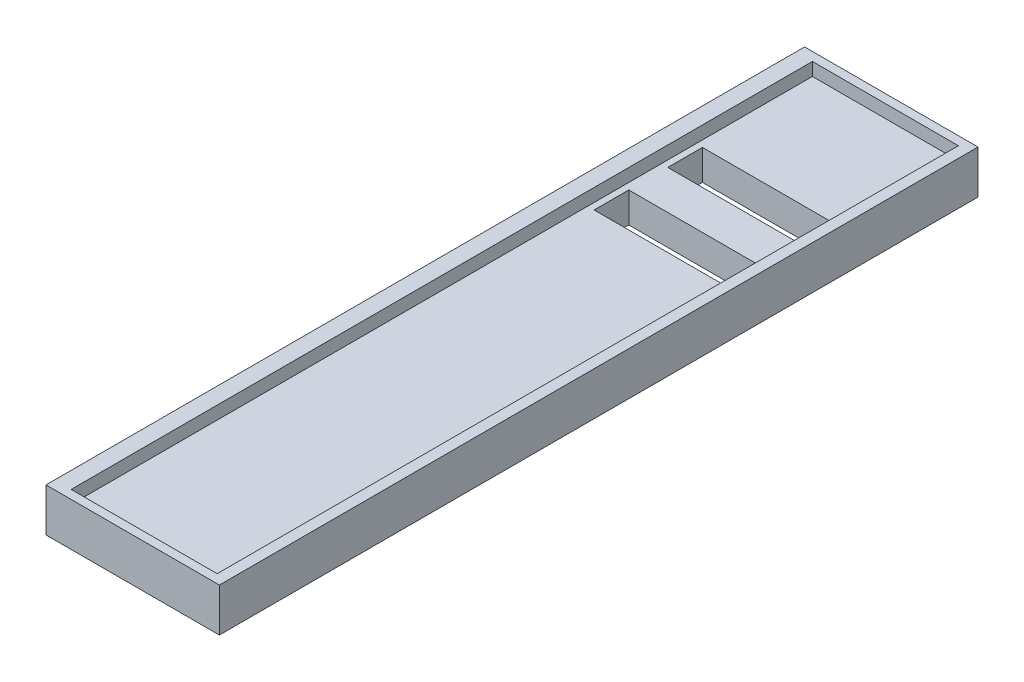
ISO-10303-21;
HEADER;
FILE_DESCRIPTION(('STEP AP214'),'2;1');
FILE_NAME('part.step','',(''),(''),'','','');
FILE_SCHEMA(('AUTOMOTIVE_DESIGN { 1 0 10303 214 1 1 1 1 }'));
ENDSEC;
DATA;
#1=APPLICATION_CONTEXT('core data for automotive mechanical design processes');
#2=APPLICATION_PROTOCOL_DEFINITION('international standard','automotive_design',2000,#1);
#3=PRODUCT_CONTEXT('',#1,'mechanical');
#4=PRODUCT('Part','Part','',(#3));
#5=PRODUCT_RELATED_PRODUCT_CATEGORY('part','',(#4));
#6=PRODUCT_DEFINITION_FORMATION('','',#4);
#7=PRODUCT_DEFINITION_CONTEXT('part definition',#1,'design');
#8=PRODUCT_DEFINITION('design','',#6,#7);
#9=PRODUCT_DEFINITION_SHAPE('','',#8);
#10=(LENGTH_UNIT() NAMED_UNIT(*) SI_UNIT(.MILLI.,.METRE.));
#11=(NAMED_UNIT(*) PLANE_ANGLE_UNIT() SI_UNIT($,.RADIAN.));
#12=(NAMED_UNIT(*) SI_UNIT($,.STERADIAN.) SOLID_ANGLE_UNIT());
#13=UNCERTAINTY_MEASURE_WITH_UNIT(LENGTH_MEASURE(1.E-05),#10,'distance_accuracy_value','');
#14=(GEOMETRIC_REPRESENTATION_CONTEXT(3) GLOBAL_UNCERTAINTY_ASSIGNED_CONTEXT((#13)) GLOBAL_UNIT_ASSIGNED_CONTEXT((#10,
#11,#12)) REPRESENTATION_CONTEXT('',''));
#15=CARTESIAN_POINT('',(0.,0.,0.));
#16=DIRECTION('',(0.,0.,1.));
#17=DIRECTION('',(1.,0.,0.));
#18=AXIS2_PLACEMENT_3D('',#15,#16,#17);
#19=CARTESIAN_POINT('',(-38.2318353475222,4.41481890999337,0.));
#20=DIRECTION('',(-1.,0.,0.));
#21=DIRECTION('',(0.,0.,1.));
#22=AXIS2_PLACEMENT_3D('',#19,#20,#21);
#23=PLANE('',#22);
#24=DIRECTION('',(0.,1.,0.));
#25=VECTOR('',#24,1.);
#26=CARTESIAN_POINT('',(-38.2318353475222,4.41481890999337,4.));
#27=LINE('',#26,#25);
#28=CARTESIAN_POINT('',(-38.2318353475222,-1.58518109000663,4.));
#29=VERTEX_POINT('',#28);
#30=CARTESIAN_POINT('',(-38.2318353475222,4.41481890999337,4.));
#31=VERTEX_POINT('',#30);
#32=EDGE_CURVE('E154',#29,#31,#27,.T.);
#33=ORIENTED_EDGE('',*,*,#32,.T.);
#34=DIRECTION('',(0.,0.,1.));
#35=VECTOR('',#34,1.);
#36=CARTESIAN_POINT('',(-38.2318353475222,4.41481890999337,0.));
#37=LINE('',#36,#35);
#38=CARTESIAN_POINT('',(-38.2318353475222,4.41481890999337,346.));
#39=VERTEX_POINT('',#38);
#40=EDGE_CURVE('E49',#31,#39,#37,.T.);
#41=ORIENTED_EDGE('',*,*,#40,.T.);
#42=DIRECTION('',(0.,-1.,0.));
#43=VECTOR('',#42,1.);
#44=CARTESIAN_POINT('',(-38.2318353475222,4.41481890999337,346.));
#45=LINE('',#44,#43);
#46=CARTESIAN_POINT('',(-38.2318353475222,-1.58518109000663,346.));
#47=VERTEX_POINT('',#46);
#48=EDGE_CURVE('E246',#39,#47,#45,.T.);
#49=ORIENTED_EDGE('',*,*,#48,.T.);
#50=DIRECTION('',(0.,0.,1.));
#51=VECTOR('',#50,1.);
#52=CARTESIAN_POINT('',(-38.2318353475222,-1.58518109000663,0.));
#53=LINE('',#52,#51);
#54=EDGE_CURVE('E168',#29,#47,#53,.T.);
#55=ORIENTED_EDGE('',*,*,#54,.F.);
#56=EDGE_LOOP('',(#33,#41,#49,#55));
#57=FACE_BOUND('',#56,.T.);
#58=ADVANCED_FACE('F34',(#57),#23,.F.);
#59=CARTESIAN_POINT('',(29.1238128532457,4.41481890999337,0.));
#60=DIRECTION('',(1.,0.,0.));
#61=DIRECTION('',(0.,0.,-1.));
#62=AXIS2_PLACEMENT_3D('',#59,#60,#61);
#63=PLANE('',#62);
#64=DIRECTION('',(0.,-1.,0.));
#65=VECTOR('',#64,1.);
#66=CARTESIAN_POINT('',(29.1238128532457,4.41481890999337,4.));
#67=LINE('',#66,#65);
#68=CARTESIAN_POINT('',(29.1238128532457,4.41481890999337,4.));
#69=VERTEX_POINT('',#68);
#70=CARTESIAN_POINT('',(29.1238128532457,-1.58518109000663,4.));
#71=VERTEX_POINT('',#70);
#72=EDGE_CURVE('E153',#69,#71,#67,.T.);
#73=ORIENTED_EDGE('',*,*,#72,.T.);
#74=DIRECTION('',(0.,0.,1.));
#75=VECTOR('',#74,1.);
#76=CARTESIAN_POINT('',(29.1238128532457,-1.58518109000663,0.));
#77=LINE('',#76,#75);
#78=CARTESIAN_POINT('',(29.1238128532457,-1.58518109000663,346.));
#79=VERTEX_POINT('',#78);
#80=EDGE_CURVE('E161',#71,#79,#77,.T.);
#81=ORIENTED_EDGE('',*,*,#80,.T.);
#82=DIRECTION('',(0.,1.,0.));
#83=VECTOR('',#82,1.);
#84=CARTESIAN_POINT('',(29.1238128532457,4.41481890999337,346.));
#85=LINE('',#84,#83);
#86=CARTESIAN_POINT('',(29.1238128532457,4.41481890999337,346.));
#87=VERTEX_POINT('',#86);
#88=EDGE_CURVE('E252',#79,#87,#85,.T.);
#89=ORIENTED_EDGE('',*,*,#88,.T.);
#90=DIRECTION('',(0.,0.,1.));
#91=VECTOR('',#90,1.);
#92=CARTESIAN_POINT('',(29.1238128532457,4.41481890999337,0.));
#93=LINE('',#92,#91);
#94=EDGE_CURVE('E57',#69,#87,#93,.T.);
#95=ORIENTED_EDGE('',*,*,#94,.F.);
#96=EDGE_LOOP('',(#73,#81,#89,#95));
#97=FACE_BOUND('',#96,.T.);
#98=ADVANCED_FACE('F160',(#97),#63,.F.);
#99=CARTESIAN_POINT('',(-38.2318353475222,-1.58518109000663,0.));
#100=DIRECTION('',(0.,-1.,0.));
#101=DIRECTION('',(0.,0.,-1.));
#102=AXIS2_PLACEMENT_3D('',#99,#100,#101);
#103=PLANE('',#102);
#104=DIRECTION('',(1.,0.,0.));
#105=VECTOR('',#104,1.);
#106=CARTESIAN_POINT('',(-35.250457763766,-1.58518109000663,107.711329479806));
#107=LINE('',#106,#105);
#108=CARTESIAN_POINT('',(-35.250457763766,-1.58518109000663,107.711329479806));
#109=VERTEX_POINT('',#108);
#110=CARTESIAN_POINT('',(25.0515059326233,-1.58518109000663,107.711329479806));
#111=VERTEX_POINT('',#110);
#112=EDGE_CURVE('E271',#109,#111,#107,.T.);
#113=ORIENTED_EDGE('',*,*,#112,.F.);
#114=DIRECTION('',(0.,0.,1.));
#115=VECTOR('',#114,1.);
#116=CARTESIAN_POINT('',(-35.250457763766,-1.58518109000663,91.7113294798061));
#117=LINE('',#116,#115);
#118=CARTESIAN_POINT('',(-35.250457763766,-1.58518109000663,91.7113294798061));
#119=VERTEX_POINT('',#118);
#120=EDGE_CURVE('E256',#119,#109,#117,.T.);
#121=ORIENTED_EDGE('',*,*,#120,.F.);
#122=DIRECTION('',(-1.,0.,0.));
#123=VECTOR('',#122,1.);
#124=CARTESIAN_POINT('',(-35.250457763766,-1.58518109000663,91.7113294798061));
#125=LINE('',#124,#123);
#126=CARTESIAN_POINT('',(25.0515059326233,-1.58518109000663,91.7113294798061));
#127=VERTEX_POINT('',#126);
#128=EDGE_CURVE('E261',#127,#119,#125,.T.);
#129=ORIENTED_EDGE('',*,*,#128,.F.);
#130=DIRECTION('',(0.,0.,-1.));
#131=VECTOR('',#130,1.);
#132=CARTESIAN_POINT('',(25.0515059326233,-1.58518109000663,91.7113294798061));
#133=LINE('',#132,#131);
#134=EDGE_CURVE('E274',#111,#127,#133,.T.);
#135=ORIENTED_EDGE('',*,*,#134,.F.);
#136=EDGE_LOOP('',(#113,#121,#129,#135));
#137=FACE_BOUND('',#136,.T.);
#138=DIRECTION('',(1.,0.,0.));
#139=VECTOR('',#138,1.);
#140=CARTESIAN_POINT('',(-35.250457763766,-1.58518109000663,73.7113294798061));
#141=LINE('',#140,#139);
#142=CARTESIAN_POINT('',(-35.250457763766,-1.58518109000663,73.7113294798061));
#143=VERTEX_POINT('',#142);
#144=CARTESIAN_POINT('',(25.0515059326233,-1.58518109000663,73.7113294798061));
#145=VERTEX_POINT('',#144);
#146=EDGE_CURVE('E303',#143,#145,#141,.T.);
#147=ORIENTED_EDGE('',*,*,#146,.F.);
#148=DIRECTION('',(0.,0.,1.));
#149=VECTOR('',#148,1.);
#150=CARTESIAN_POINT('',(-35.250457763766,-1.58518109000663,73.7113294798061));
#151=LINE('',#150,#149);
#152=CARTESIAN_POINT('',(-35.250457763766,-1.58518109000663,57.7113294798061));
#153=VERTEX_POINT('',#152);
#154=EDGE_CURVE('E281',#153,#143,#151,.T.);
#155=ORIENTED_EDGE('',*,*,#154,.F.);
#156=DIRECTION('',(-1.,0.,0.));
#157=VECTOR('',#156,1.);
#158=CARTESIAN_POINT('',(-35.250457763766,-1.58518109000663,57.7113294798061));
#159=LINE('',#158,#157);
#160=CARTESIAN_POINT('',(25.0515059326233,-1.58518109000663,57.7113294798061));
#161=VERTEX_POINT('',#160);
#162=EDGE_CURVE('E292',#161,#153,#159,.T.);
#163=ORIENTED_EDGE('',*,*,#162,.F.);
#164=DIRECTION('',(0.,0.,-1.));
#165=VECTOR('',#164,1.);
#166=CARTESIAN_POINT('',(25.0515059326233,-1.58518109000663,73.7113294798061));
#167=LINE('',#166,#165);
#168=EDGE_CURVE('E306',#145,#161,#167,.T.);
#169=ORIENTED_EDGE('',*,*,#168,.F.);
#170=EDGE_LOOP('',(#147,#155,#163,#169));
#171=FACE_BOUND('',#170,.T.);
#172=DIRECTION('',(-1.,0.,0.));
#173=VECTOR('',#172,1.);
#174=CARTESIAN_POINT('',(29.1238128532457,-1.58518109000663,4.));
#175=LINE('',#174,#173);
#176=EDGE_CURVE('E150',#71,#29,#175,.T.);
#177=ORIENTED_EDGE('',*,*,#176,.T.);
#178=ORIENTED_EDGE('',*,*,#54,.T.);
#179=DIRECTION('',(1.,0.,0.));
#180=VECTOR('',#179,1.);
#181=CARTESIAN_POINT('',(-38.2318353475222,-1.58518109000663,346.));
#182=LINE('',#181,#180);
#183=EDGE_CURVE('E166',#47,#79,#182,.T.);
#184=ORIENTED_EDGE('',*,*,#183,.T.);
#185=ORIENTED_EDGE('',*,*,#80,.F.);
#186=EDGE_LOOP('',(#177,#178,#184,#185));
#187=FACE_BOUND('',#186,.T.);
#188=ADVANCED_FACE('F164',(#137,#171,#187),#103,.F.);
#189=CARTESIAN_POINT('',(-45.8316221765914,4.41481890999337,350.));
#190=DIRECTION('',(1.,0.,0.));
#191=DIRECTION('',(0.,0.,-1.));
#192=AXIS2_PLACEMENT_3D('',#189,#190,#191);
#193=PLANE('',#192);
#194=DIRECTION('',(0.,-1.,0.));
#195=VECTOR('',#194,1.);
#196=CARTESIAN_POINT('',(-45.8316221765914,4.41481890999337,0.));
#197=LINE('',#196,#195);
#198=CARTESIAN_POINT('',(-45.8316221765914,4.41481890999337,0.));
#199=VERTEX_POINT('',#198);
#200=CARTESIAN_POINT('',(-45.8316221765914,-15.5851810900066,0.));
#201=VERTEX_POINT('',#200);
#202=EDGE_CURVE('E186',#199,#201,#197,.T.);
#203=ORIENTED_EDGE('',*,*,#202,.T.);
#204=DIRECTION('',(0.,0.,-1.));
#205=VECTOR('',#204,1.);
#206=CARTESIAN_POINT('',(-45.8316221765914,-15.5851810900066,350.));
#207=LINE('',#206,#205);
#208=CARTESIAN_POINT('',(-45.8316221765914,-15.5851810900066,350.));
#209=VERTEX_POINT('',#208);
#210=EDGE_CURVE('E11',#209,#201,#207,.T.);
#211=ORIENTED_EDGE('',*,*,#210,.F.);
#212=DIRECTION('',(0.,-1.,0.));
#213=VECTOR('',#212,1.);
#214=CARTESIAN_POINT('',(-45.8316221765914,4.41481890999337,350.));
#215=LINE('',#214,#213);
#216=CARTESIAN_POINT('',(-45.8316221765914,4.41481890999337,350.));
#217=VERTEX_POINT('',#216);
#218=EDGE_CURVE('E175',#217,#209,#215,.T.);
#219=ORIENTED_EDGE('',*,*,#218,.F.);
#220=DIRECTION('',(0.,0.,-1.));
#221=VECTOR('',#220,1.);
#222=CARTESIAN_POINT('',(-45.8316221765914,4.41481890999337,350.));
#223=LINE('',#222,#221);
#224=EDGE_CURVE('E185',#217,#199,#223,.T.);
#225=ORIENTED_EDGE('',*,*,#224,.T.);
#226=EDGE_LOOP('',(#203,#211,#219,#225));
#227=FACE_BOUND('',#226,.T.);
#228=ADVANCED_FACE('F36',(#227),#193,.F.);
#229=CARTESIAN_POINT('',(-45.8316221765914,-15.5851810900066,350.));
#230=DIRECTION('',(0.,1.,0.));
#231=DIRECTION('',(0.,0.,1.));
#232=AXIS2_PLACEMENT_3D('',#229,#230,#231);
#233=PLANE('',#232);
#234=DIRECTION('',(-1.,0.,0.));
#235=VECTOR('',#234,1.);
#236=CARTESIAN_POINT('',(-35.250457763766,-15.5851810900066,91.7113294798061));
#237=LINE('',#236,#235);
#238=CARTESIAN_POINT('',(25.0515059326233,-15.5851810900066,91.7113294798061));
#239=VERTEX_POINT('',#238);
#240=CARTESIAN_POINT('',(-35.250457763766,-15.5851810900066,91.7113294798061));
#241=VERTEX_POINT('',#240);
#242=EDGE_CURVE('E267',#239,#241,#237,.T.);
#243=ORIENTED_EDGE('',*,*,#242,.T.);
#244=DIRECTION('',(0.,0.,1.));
#245=VECTOR('',#244,1.);
#246=CARTESIAN_POINT('',(-35.250457763766,-15.5851810900066,91.7113294798061));
#247=LINE('',#246,#245);
#248=CARTESIAN_POINT('',(-35.250457763766,-15.5851810900066,107.711329479806));
#249=VERTEX_POINT('',#248);
#250=EDGE_CURVE('E257',#241,#249,#247,.T.);
#251=ORIENTED_EDGE('',*,*,#250,.T.);
#252=DIRECTION('',(1.,0.,0.));
#253=VECTOR('',#252,1.);
#254=CARTESIAN_POINT('',(-35.250457763766,-15.5851810900066,107.711329479806));
#255=LINE('',#254,#253);
#256=CARTESIAN_POINT('',(25.0515059326233,-15.5851810900066,107.711329479806));
#257=VERTEX_POINT('',#256);
#258=EDGE_CURVE('E260',#249,#257,#255,.T.);
#259=ORIENTED_EDGE('',*,*,#258,.T.);
#260=DIRECTION('',(0.,0.,-1.));
#261=VECTOR('',#260,1.);
#262=CARTESIAN_POINT('',(25.0515059326233,-15.5851810900066,91.7113294798061));
#263=LINE('',#262,#261);
#264=EDGE_CURVE('E264',#257,#239,#263,.T.);
#265=ORIENTED_EDGE('',*,*,#264,.T.);
#266=EDGE_LOOP('',(#243,#251,#259,#265));
#267=FACE_BOUND('',#266,.T.);
#268=DIRECTION('',(-1.,0.,0.));
#269=VECTOR('',#268,1.);
#270=CARTESIAN_POINT('',(-35.250457763766,-15.5851810900066,57.7113294798061));
#271=LINE('',#270,#269);
#272=CARTESIAN_POINT('',(25.0515059326233,-15.5851810900066,57.7113294798061));
#273=VERTEX_POINT('',#272);
#274=CARTESIAN_POINT('',(-35.250457763766,-15.5851810900066,57.7113294798061));
#275=VERTEX_POINT('',#274);
#276=EDGE_CURVE('E298',#273,#275,#271,.T.);
#277=ORIENTED_EDGE('',*,*,#276,.T.);
#278=DIRECTION('',(0.,0.,1.));
#279=VECTOR('',#278,1.);
#280=CARTESIAN_POINT('',(-35.250457763766,-15.5851810900066,73.7113294798061));
#281=LINE('',#280,#279);
#282=CARTESIAN_POINT('',(-35.250457763766,-15.5851810900066,73.7113294798061));
#283=VERTEX_POINT('',#282);
#284=EDGE_CURVE('E288',#275,#283,#281,.T.);
#285=ORIENTED_EDGE('',*,*,#284,.T.);
#286=DIRECTION('',(1.,0.,0.));
#287=VECTOR('',#286,1.);
#288=CARTESIAN_POINT('',(-35.250457763766,-15.5851810900066,73.7113294798061));
#289=LINE('',#288,#287);
#290=CARTESIAN_POINT('',(25.0515059326233,-15.5851810900066,73.7113294798061));
#291=VERTEX_POINT('',#290);
#292=EDGE_CURVE('E291',#283,#291,#289,.T.);
#293=ORIENTED_EDGE('',*,*,#292,.T.);
#294=DIRECTION('',(0.,0.,-1.));
#295=VECTOR('',#294,1.);
#296=CARTESIAN_POINT('',(25.0515059326233,-15.5851810900066,73.7113294798061));
#297=LINE('',#296,#295);
#298=EDGE_CURVE('E295',#291,#273,#297,.T.);
#299=ORIENTED_EDGE('',*,*,#298,.T.);
#300=EDGE_LOOP('',(#277,#285,#293,#299));
#301=FACE_BOUND('',#300,.T.);
#302=DIRECTION('',(1.,0.,0.));
#303=VECTOR('',#302,1.);
#304=CARTESIAN_POINT('',(-45.8316221765914,-15.5851810900066,0.));
#305=LINE('',#304,#303);
#306=CARTESIAN_POINT('',(34.1683778234086,-15.5851810900066,0.));
#307=VERTEX_POINT('',#306);
#308=EDGE_CURVE('E189',#201,#307,#305,.T.);
#309=ORIENTED_EDGE('',*,*,#308,.T.);
#310=DIRECTION('',(0.,0.,-1.));
#311=VECTOR('',#310,1.);
#312=CARTESIAN_POINT('',(34.1683778234086,-15.5851810900066,350.));
#313=LINE('',#312,#311);
#314=CARTESIAN_POINT('',(34.1683778234086,-15.5851810900066,350.));
#315=VERTEX_POINT('',#314);
#316=EDGE_CURVE('E42',#315,#307,#313,.T.);
#317=ORIENTED_EDGE('',*,*,#316,.F.);
#318=DIRECTION('',(1.,0.,0.));
#319=VECTOR('',#318,1.);
#320=CARTESIAN_POINT('',(-45.8316221765914,-15.5851810900066,350.));
#321=LINE('',#320,#319);
#322=EDGE_CURVE('E178',#209,#315,#321,.T.);
#323=ORIENTED_EDGE('',*,*,#322,.F.);
#324=ORIENTED_EDGE('',*,*,#210,.T.);
#325=EDGE_LOOP('',(#309,#317,#323,#324));
#326=FACE_BOUND('',#325,.T.);
#327=ADVANCED_FACE('F219',(#267,#301,#326),#233,.F.);
#328=CARTESIAN_POINT('',(34.1683778234086,4.41481890999337,350.));
#329=DIRECTION('',(-1.,0.,0.));
#330=DIRECTION('',(0.,0.,1.));
#331=AXIS2_PLACEMENT_3D('',#328,#329,#330);
#332=PLANE('',#331);
#333=DIRECTION('',(0.,1.,0.));
#334=VECTOR('',#333,1.);
#335=CARTESIAN_POINT('',(34.1683778234086,4.41481890999337,0.));
#336=LINE('',#335,#334);
#337=CARTESIAN_POINT('',(34.1683778234086,4.41481890999337,0.));
#338=VERTEX_POINT('',#337);
#339=EDGE_CURVE('E191',#307,#338,#336,.T.);
#340=ORIENTED_EDGE('',*,*,#339,.T.);
#341=DIRECTION('',(0.,0.,-1.));
#342=VECTOR('',#341,1.);
#343=CARTESIAN_POINT('',(34.1683778234086,4.41481890999337,350.));
#344=LINE('',#343,#342);
#345=CARTESIAN_POINT('',(34.1683778234086,4.41481890999337,350.));
#346=VERTEX_POINT('',#345);
#347=EDGE_CURVE('E196',#346,#338,#344,.T.);
#348=ORIENTED_EDGE('',*,*,#347,.F.);
#349=DIRECTION('',(0.,1.,0.));
#350=VECTOR('',#349,1.);
#351=CARTESIAN_POINT('',(34.1683778234086,4.41481890999337,350.));
#352=LINE('',#351,#350);
#353=EDGE_CURVE('E181',#315,#346,#352,.T.);
#354=ORIENTED_EDGE('',*,*,#353,.F.);
#355=ORIENTED_EDGE('',*,*,#316,.T.);
#356=EDGE_LOOP('',(#340,#348,#354,#355));
#357=FACE_BOUND('',#356,.T.);
#358=ADVANCED_FACE('F203',(#357),#332,.F.);
#359=CARTESIAN_POINT('',(-45.8316221765914,4.41481890999337,350.));
#360=DIRECTION('',(0.,-1.,0.));
#361=DIRECTION('',(0.,0.,-1.));
#362=AXIS2_PLACEMENT_3D('',#359,#360,#361);
#363=PLANE('',#362);
#364=DIRECTION('',(1.,0.,0.));
#365=VECTOR('',#364,1.);
#366=CARTESIAN_POINT('',(29.1238128532457,4.41481890999337,4.));
#367=LINE('',#366,#365);
#368=EDGE_CURVE('E245',#31,#69,#367,.T.);
#369=ORIENTED_EDGE('',*,*,#368,.T.);
#370=ORIENTED_EDGE('',*,*,#94,.T.);
#371=DIRECTION('',(-1.,0.,0.));
#372=VECTOR('',#371,1.);
#373=CARTESIAN_POINT('',(-38.2318353475222,4.41481890999337,346.));
#374=LINE('',#373,#372);
#375=EDGE_CURVE('E254',#87,#39,#374,.T.);
#376=ORIENTED_EDGE('',*,*,#375,.T.);
#377=ORIENTED_EDGE('',*,*,#40,.F.);
#378=EDGE_LOOP('',(#369,#370,#376,#377));
#379=FACE_BOUND('',#378,.T.);
#380=DIRECTION('',(-1.,0.,0.));
#381=VECTOR('',#380,1.);
#382=CARTESIAN_POINT('',(-45.8316221765914,4.41481890999337,0.));
#383=LINE('',#382,#381);
#384=EDGE_CURVE('E179',#338,#199,#383,.T.);
#385=ORIENTED_EDGE('',*,*,#384,.T.);
#386=ORIENTED_EDGE('',*,*,#224,.F.);
#387=DIRECTION('',(-1.,0.,0.));
#388=VECTOR('',#387,1.);
#389=CARTESIAN_POINT('',(-45.8316221765914,4.41481890999337,350.));
#390=LINE('',#389,#388);
#391=EDGE_CURVE('E183',#346,#217,#390,.T.);
#392=ORIENTED_EDGE('',*,*,#391,.F.);
#393=ORIENTED_EDGE('',*,*,#347,.T.);
#394=EDGE_LOOP('',(#385,#386,#392,#393));
#395=FACE_BOUND('',#394,.T.);
#396=ADVANCED_FACE('F212',(#379,#395),#363,.F.);
#397=CARTESIAN_POINT('',(0.,0.,350.));
#398=DIRECTION('',(0.,0.,1.));
#399=DIRECTION('',(1.,0.,0.));
#400=AXIS2_PLACEMENT_3D('',#397,#398,#399);
#401=PLANE('',#400);
#402=ORIENTED_EDGE('',*,*,#391,.T.);
#403=ORIENTED_EDGE('',*,*,#218,.T.);
#404=ORIENTED_EDGE('',*,*,#322,.T.);
#405=ORIENTED_EDGE('',*,*,#353,.T.);
#406=EDGE_LOOP('',(#402,#403,#404,#405));
#407=FACE_BOUND('',#406,.T.);
#408=ADVANCED_FACE('F218',(#407),#401,.T.);
#409=CARTESIAN_POINT('',(0.,0.,0.));
#410=DIRECTION('',(0.,0.,1.));
#411=DIRECTION('',(1.,0.,0.));
#412=AXIS2_PLACEMENT_3D('',#409,#410,#411);
#413=PLANE('',#412);
#414=ORIENTED_EDGE('',*,*,#202,.F.);
#415=ORIENTED_EDGE('',*,*,#384,.F.);
#416=ORIENTED_EDGE('',*,*,#339,.F.);
#417=ORIENTED_EDGE('',*,*,#308,.F.);
#418=EDGE_LOOP('',(#414,#415,#416,#417));
#419=FACE_BOUND('',#418,.T.);
#420=ADVANCED_FACE('F209',(#419),#413,.F.);
#421=CARTESIAN_POINT('',(-35.250457763766,-15.5851810900066,73.7113294798061));
#422=DIRECTION('',(-1.,0.,0.));
#423=DIRECTION('',(0.,0.,1.));
#424=AXIS2_PLACEMENT_3D('',#421,#422,#423);
#425=PLANE('',#424);
#426=ORIENTED_EDGE('',*,*,#154,.T.);
#427=DIRECTION('',(0.,1.,0.));
#428=VECTOR('',#427,1.);
#429=CARTESIAN_POINT('',(-35.250457763766,-15.5851810900066,73.7113294798061));
#430=LINE('',#429,#428);
#431=EDGE_CURVE('E301',#283,#143,#430,.T.);
#432=ORIENTED_EDGE('',*,*,#431,.F.);
#433=ORIENTED_EDGE('',*,*,#284,.F.);
#434=DIRECTION('',(0.,1.,0.));
#435=VECTOR('',#434,1.);
#436=CARTESIAN_POINT('',(-35.250457763766,-15.5851810900066,57.7113294798061));
#437=LINE('',#436,#435);
#438=EDGE_CURVE('E171',#275,#153,#437,.T.);
#439=ORIENTED_EDGE('',*,*,#438,.T.);
#440=EDGE_LOOP('',(#426,#432,#433,#439));
#441=FACE_BOUND('',#440,.T.);
#442=ADVANCED_FACE('F241',(#441),#425,.F.);
#443=CARTESIAN_POINT('',(-35.250457763766,-15.5851810900066,57.7113294798061));
#444=DIRECTION('',(0.,0.,-1.));
#445=DIRECTION('',(-1.,0.,0.));
#446=AXIS2_PLACEMENT_3D('',#443,#444,#445);
#447=PLANE('',#446);
#448=ORIENTED_EDGE('',*,*,#162,.T.);
#449=ORIENTED_EDGE('',*,*,#438,.F.);
#450=ORIENTED_EDGE('',*,*,#276,.F.);
#451=DIRECTION('',(0.,1.,0.));
#452=VECTOR('',#451,1.);
#453=CARTESIAN_POINT('',(25.0515059326233,-15.5851810900066,57.7113294798061));
#454=LINE('',#453,#452);
#455=EDGE_CURVE('E312',#273,#161,#454,.T.);
#456=ORIENTED_EDGE('',*,*,#455,.T.);
#457=EDGE_LOOP('',(#448,#449,#450,#456));
#458=FACE_BOUND('',#457,.T.);
#459=ADVANCED_FACE('F332',(#458),#447,.F.);
#460=CARTESIAN_POINT('',(25.0515059326233,-15.5851810900066,73.7113294798061));
#461=DIRECTION('',(1.,0.,0.));
#462=DIRECTION('',(0.,0.,-1.));
#463=AXIS2_PLACEMENT_3D('',#460,#461,#462);
#464=PLANE('',#463);
#465=ORIENTED_EDGE('',*,*,#168,.T.);
#466=ORIENTED_EDGE('',*,*,#455,.F.);
#467=ORIENTED_EDGE('',*,*,#298,.F.);
#468=DIRECTION('',(0.,1.,0.));
#469=VECTOR('',#468,1.);
#470=CARTESIAN_POINT('',(25.0515059326233,-15.5851810900066,73.7113294798061));
#471=LINE('',#470,#469);
#472=EDGE_CURVE('E314',#291,#145,#471,.T.);
#473=ORIENTED_EDGE('',*,*,#472,.T.);
#474=EDGE_LOOP('',(#465,#466,#467,#473));
#475=FACE_BOUND('',#474,.T.);
#476=ADVANCED_FACE('F329',(#475),#464,.F.);
#477=CARTESIAN_POINT('',(-35.250457763766,-15.5851810900066,73.7113294798061));
#478=DIRECTION('',(0.,0.,1.));
#479=DIRECTION('',(1.,0.,0.));
#480=AXIS2_PLACEMENT_3D('',#477,#478,#479);
#481=PLANE('',#480);
#482=ORIENTED_EDGE('',*,*,#146,.T.);
#483=ORIENTED_EDGE('',*,*,#472,.F.);
#484=ORIENTED_EDGE('',*,*,#292,.F.);
#485=ORIENTED_EDGE('',*,*,#431,.T.);
#486=EDGE_LOOP('',(#482,#483,#484,#485));
#487=FACE_BOUND('',#486,.T.);
#488=ADVANCED_FACE('F320',(#487),#481,.F.);
#489=CARTESIAN_POINT('',(-35.250457763766,-15.5851810900066,91.7113294798061));
#490=DIRECTION('',(-1.,0.,0.));
#491=DIRECTION('',(0.,0.,1.));
#492=AXIS2_PLACEMENT_3D('',#489,#490,#491);
#493=PLANE('',#492);
#494=ORIENTED_EDGE('',*,*,#120,.T.);
#495=DIRECTION('',(0.,1.,0.));
#496=VECTOR('',#495,1.);
#497=CARTESIAN_POINT('',(-35.250457763766,-15.5851810900066,107.711329479806));
#498=LINE('',#497,#496);
#499=EDGE_CURVE('E269',#249,#109,#498,.T.);
#500=ORIENTED_EDGE('',*,*,#499,.F.);
#501=ORIENTED_EDGE('',*,*,#250,.F.);
#502=DIRECTION('',(0.,1.,0.));
#503=VECTOR('',#502,1.);
#504=CARTESIAN_POINT('',(-35.250457763766,-15.5851810900066,91.7113294798061));
#505=LINE('',#504,#503);
#506=EDGE_CURVE('E279',#241,#119,#505,.T.);
#507=ORIENTED_EDGE('',*,*,#506,.T.);
#508=EDGE_LOOP('',(#494,#500,#501,#507));
#509=FACE_BOUND('',#508,.T.);
#510=ADVANCED_FACE('F342',(#509),#493,.F.);
#511=CARTESIAN_POINT('',(-35.250457763766,-15.5851810900066,91.7113294798061));
#512=DIRECTION('',(0.,0.,-1.));
#513=DIRECTION('',(-1.,0.,0.));
#514=AXIS2_PLACEMENT_3D('',#511,#512,#513);
#515=PLANE('',#514);
#516=ORIENTED_EDGE('',*,*,#128,.T.);
#517=ORIENTED_EDGE('',*,*,#506,.F.);
#518=ORIENTED_EDGE('',*,*,#242,.F.);
#519=DIRECTION('',(0.,1.,0.));
#520=VECTOR('',#519,1.);
#521=CARTESIAN_POINT('',(25.0515059326233,-15.5851810900066,91.7113294798061));
#522=LINE('',#521,#520);
#523=EDGE_CURVE('E282',#239,#127,#522,.T.);
#524=ORIENTED_EDGE('',*,*,#523,.T.);
#525=EDGE_LOOP('',(#516,#517,#518,#524));
#526=FACE_BOUND('',#525,.T.);
#527=ADVANCED_FACE('F349',(#526),#515,.F.);
#528=CARTESIAN_POINT('',(25.0515059326233,-15.5851810900066,91.7113294798061));
#529=DIRECTION('',(1.,0.,0.));
#530=DIRECTION('',(0.,0.,-1.));
#531=AXIS2_PLACEMENT_3D('',#528,#529,#530);
#532=PLANE('',#531);
#533=ORIENTED_EDGE('',*,*,#134,.T.);
#534=ORIENTED_EDGE('',*,*,#523,.F.);
#535=ORIENTED_EDGE('',*,*,#264,.F.);
#536=DIRECTION('',(0.,1.,0.));
#537=VECTOR('',#536,1.);
#538=CARTESIAN_POINT('',(25.0515059326233,-15.5851810900066,107.711329479806));
#539=LINE('',#538,#537);
#540=EDGE_CURVE('E284',#257,#111,#539,.T.);
#541=ORIENTED_EDGE('',*,*,#540,.T.);
#542=EDGE_LOOP('',(#533,#534,#535,#541));
#543=FACE_BOUND('',#542,.T.);
#544=ADVANCED_FACE('F354',(#543),#532,.F.);
#545=CARTESIAN_POINT('',(-35.250457763766,-15.5851810900066,107.711329479806));
#546=DIRECTION('',(0.,0.,1.));
#547=DIRECTION('',(1.,0.,0.));
#548=AXIS2_PLACEMENT_3D('',#545,#546,#547);
#549=PLANE('',#548);
#550=ORIENTED_EDGE('',*,*,#112,.T.);
#551=ORIENTED_EDGE('',*,*,#540,.F.);
#552=ORIENTED_EDGE('',*,*,#258,.F.);
#553=ORIENTED_EDGE('',*,*,#499,.T.);
#554=EDGE_LOOP('',(#550,#551,#552,#553));
#555=FACE_BOUND('',#554,.T.);
#556=ADVANCED_FACE('F364',(#555),#549,.F.);
#557=CARTESIAN_POINT('',(0.,0.,346.));
#558=DIRECTION('',(0.,0.,1.));
#559=DIRECTION('',(1.,0.,0.));
#560=AXIS2_PLACEMENT_3D('',#557,#558,#559);
#561=PLANE('',#560);
#562=ORIENTED_EDGE('',*,*,#48,.F.);
#563=ORIENTED_EDGE('',*,*,#375,.F.);
#564=ORIENTED_EDGE('',*,*,#88,.F.);
#565=ORIENTED_EDGE('',*,*,#183,.F.);
#566=EDGE_LOOP('',(#562,#563,#564,#565));
#567=FACE_BOUND('',#566,.T.);
#568=ADVANCED_FACE('F374',(#567),#561,.F.);
#569=CARTESIAN_POINT('',(0.,0.,4.));
#570=DIRECTION('',(0.,0.,-1.));
#571=DIRECTION('',(-1.,0.,0.));
#572=AXIS2_PLACEMENT_3D('',#569,#570,#571);
#573=PLANE('',#572);
#574=ORIENTED_EDGE('',*,*,#72,.F.);
#575=ORIENTED_EDGE('',*,*,#368,.F.);
#576=ORIENTED_EDGE('',*,*,#32,.F.);
#577=ORIENTED_EDGE('',*,*,#176,.F.);
#578=EDGE_LOOP('',(#574,#575,#576,#577));
#579=FACE_BOUND('',#578,.T.);
#580=ADVANCED_FACE('F152',(#579),#573,.F.);
#581=CLOSED_SHELL('',(#58,#98,#188,#228,#327,#358,#396,#408,#420,#442,#459,#476,#488,#510,#527,
#544,#556,#568,#580));
#582=MANIFOLD_SOLID_BREP('B2',#581);
#583=ADVANCED_BREP_SHAPE_REPRESENTATION('',(#18,#582),#14);
#584=SHAPE_DEFINITION_REPRESENTATION(#9,#583);
ENDSEC;
END-ISO-10303-21;
